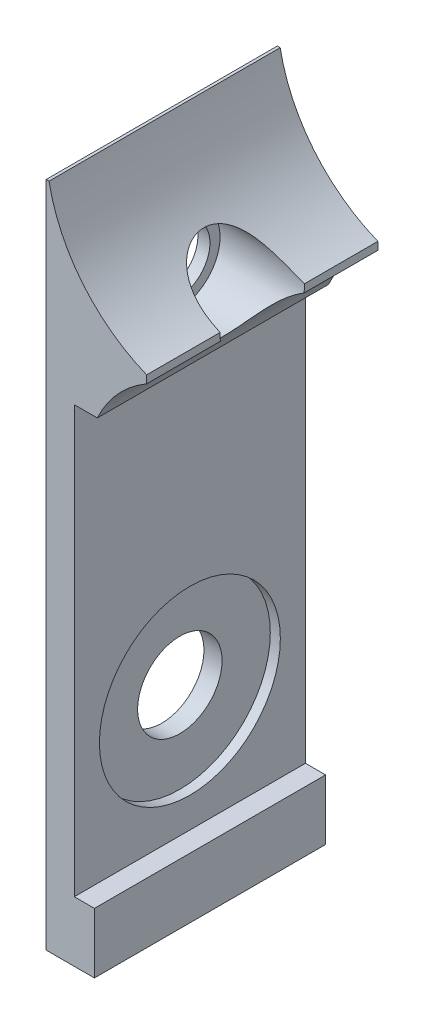
ISO-10303-21;
HEADER;
FILE_DESCRIPTION(('STEP AP214'),'2;1');
FILE_NAME('part.step','',(''),(''),'','','');
FILE_SCHEMA(('AUTOMOTIVE_DESIGN { 1 0 10303 214 1 1 1 1 }'));
ENDSEC;
DATA;
#1=APPLICATION_CONTEXT('core data for automotive mechanical design processes');
#2=APPLICATION_PROTOCOL_DEFINITION('international standard','automotive_design',2000,#1);
#3=PRODUCT_CONTEXT('',#1,'mechanical');
#4=PRODUCT('Part','Part','',(#3));
#5=PRODUCT_RELATED_PRODUCT_CATEGORY('part','',(#4));
#6=PRODUCT_DEFINITION_FORMATION('','',#4);
#7=PRODUCT_DEFINITION_CONTEXT('part definition',#1,'design');
#8=PRODUCT_DEFINITION('design','',#6,#7);
#9=PRODUCT_DEFINITION_SHAPE('','',#8);
#10=(LENGTH_UNIT() NAMED_UNIT(*) SI_UNIT(.MILLI.,.METRE.));
#11=(NAMED_UNIT(*) PLANE_ANGLE_UNIT() SI_UNIT($,.RADIAN.));
#12=(NAMED_UNIT(*) SI_UNIT($,.STERADIAN.) SOLID_ANGLE_UNIT());
#13=UNCERTAINTY_MEASURE_WITH_UNIT(LENGTH_MEASURE(1.E-05),#10,'distance_accuracy_value','');
#14=(GEOMETRIC_REPRESENTATION_CONTEXT(3) GLOBAL_UNCERTAINTY_ASSIGNED_CONTEXT((#13)) GLOBAL_UNIT_ASSIGNED_CONTEXT((#10,
#11,#12)) REPRESENTATION_CONTEXT('',''));
#15=CARTESIAN_POINT('',(0.,0.,0.));
#16=DIRECTION('',(0.,0.,1.));
#17=DIRECTION('',(1.,0.,0.));
#18=AXIS2_PLACEMENT_3D('',#15,#16,#17);
#19=CARTESIAN_POINT('',(-84.253382481582,10.8635198135198,11.5));
#20=DIRECTION('',(-1.,0.,0.));
#21=DIRECTION('',(0.,0.,1.));
#22=AXIS2_PLACEMENT_3D('',#19,#20,#21);
#23=PLANE('',#22);
#24=DIRECTION('',(0.,1.,0.));
#25=VECTOR('',#24,1.);
#26=CARTESIAN_POINT('',(-84.253382481582,10.8635198135198,11.5));
#27=LINE('',#26,#25);
#28=CARTESIAN_POINT('',(-84.253382481582,13.5596722362264,11.5));
#29=VERTEX_POINT('',#28);
#30=CARTESIAN_POINT('',(-84.253382481582,13.9473213264241,11.5));
#31=VERTEX_POINT('',#30);
#32=EDGE_CURVE('E135',#29,#31,#27,.T.);
#33=ORIENTED_EDGE('',*,*,#32,.F.);
#34=DIRECTION('',(0.,0.,1.));
#35=VECTOR('',#34,1.);
#36=CARTESIAN_POINT('',(-84.253382481582,13.5596722362264,0.));
#37=LINE('',#36,#35);
#38=CARTESIAN_POINT('',(-84.253382481582,13.5596722362264,7.82790198271549));
#39=VERTEX_POINT('',#38);
#40=EDGE_CURVE('E207',#29,#39,#37,.F.);
#41=ORIENTED_EDGE('',*,*,#40,.T.);
#42=CARTESIAN_POINT('',(-84.253382481582,13.8635198135198,5.75));
#43=DIRECTION('',(1.,0.,0.));
#44=DIRECTION('',(0.,0.,-1.));
#45=AXIS2_PLACEMENT_3D('',#42,#43,#44);
#46=CIRCLE('',#45,2.1);
#47=CARTESIAN_POINT('',(-84.253382481582,13.9473213264241,7.84832726390212));
#48=VERTEX_POINT('',#47);
#49=EDGE_CURVE('E154',#48,#39,#46,.T.);
#50=ORIENTED_EDGE('',*,*,#49,.F.);
#51=DIRECTION('',(0.,0.,1.));
#52=VECTOR('',#51,1.);
#53=CARTESIAN_POINT('',(-84.253382481582,13.9473213264241,0.));
#54=LINE('',#53,#52);
#55=EDGE_CURVE('E126',#48,#31,#54,.T.);
#56=ORIENTED_EDGE('',*,*,#55,.T.);
#57=EDGE_LOOP('',(#33,#41,#50,#56));
#58=FACE_BOUND('',#57,.T.);
#59=ADVANCED_FACE('F32',(#58),#23,.F.);
#60=CARTESIAN_POINT('',(-89.2533824815821,13.8635198135198,5.75));
#61=DIRECTION('',(1.,0.,0.));
#62=DIRECTION('',(0.,0.,-1.));
#63=AXIS2_PLACEMENT_3D('',#60,#61,#62);
#64=CYLINDRICAL_SURFACE('',#63,2.1);
#65=ORIENTED_EDGE('',*,*,#49,.T.);
#66=CARTESIAN_POINT('',(-84.253382481582,13.5596722362264,7.82790198271549));
#67=CARTESIAN_POINT('',(-84.329372968283,13.51581055337,7.8214758453593));
#68=CARTESIAN_POINT('',(-84.4043158935709,13.4703085241428,7.81341435107651));
#69=CARTESIAN_POINT('',(-84.5518784734901,13.3762597621513,7.79325951894115));
#70=CARTESIAN_POINT('',(-84.6244940621987,13.3277080974361,7.78115950611244));
#71=CARTESIAN_POINT('',(-84.7676679897149,13.2274192268118,7.7520305151862));
#72=CARTESIAN_POINT('',(-84.8381966596658,13.1756538881626,7.73495103627666));
#73=CARTESIAN_POINT('',(-84.9758724505173,13.0699626332378,7.69511074250425));
#74=CARTESIAN_POINT('',(-85.043021829497,13.0160382041426,7.67235378363589));
#75=CARTESIAN_POINT('',(-85.2085195171252,12.8772699537405,7.60633471741659));
#76=CARTESIAN_POINT('',(-85.3042817454718,12.7913567926067,7.55862145416147));
#77=CARTESIAN_POINT('',(-85.4841340850374,12.6198212102236,7.44520293700197));
#78=CARTESIAN_POINT('',(-85.5682714971948,12.5341990820788,7.37957403576662));
#79=CARTESIAN_POINT('',(-85.710598696955,12.3812763791868,7.24059060653614));
#80=CARTESIAN_POINT('',(-85.7707870242759,12.3132278892183,7.17012553891527));
#81=CARTESIAN_POINT('',(-85.8802537001191,12.1844115091923,7.01520016766046));
#82=CARTESIAN_POINT('',(-85.9295273064635,12.1236467889945,6.93073380856484));
#83=CARTESIAN_POINT('',(-86.0163414974848,12.0130702373942,6.7486202039124));
#84=CARTESIAN_POINT('',(-86.0538124995794,11.9633238570164,6.6508994761196));
#85=CARTESIAN_POINT('',(-86.1159896376036,11.8788905774885,6.44538785526319));
#86=CARTESIAN_POINT('',(-86.1407023062407,11.8441959727654,6.33760214927018));
#87=CARTESIAN_POINT('',(-86.1751058785957,11.7953456363587,6.12806529058891));
#88=CARTESIAN_POINT('',(-86.1861545324255,11.7793445370311,6.02696265317353));
#89=CARTESIAN_POINT('',(-86.1979197112154,11.7622942267008,5.82292250237693));
#90=CARTESIAN_POINT('',(-86.1986398735105,11.761239752019,5.71998564773036));
#91=CARTESIAN_POINT('',(-86.1899630588206,11.7738303866122,5.52037149003759));
#92=CARTESIAN_POINT('',(-86.1810428960826,11.7867827321437,5.42362836992542));
#93=CARTESIAN_POINT('',(-86.1538685178083,11.8255700598249,5.2341411094351));
#94=CARTESIAN_POINT('',(-86.1356155185176,11.8514033633309,5.14139644968903));
#95=CARTESIAN_POINT('',(-86.0897171363914,11.9147727107065,4.96162090888131));
#96=CARTESIAN_POINT('',(-86.0619992504151,11.9523989022877,4.87464051562318));
#97=CARTESIAN_POINT('',(-85.9974951389084,12.0372408465453,4.7091543399511));
#98=CARTESIAN_POINT('',(-85.9607066936891,12.0844589459929,4.63065063867043));
#99=CARTESIAN_POINT('',(-85.8760606286418,12.1891739057872,4.47894955257474));
#100=CARTESIAN_POINT('',(-85.8276659715911,12.2471211837089,4.40636504812163));
#101=CARTESIAN_POINT('',(-85.722131310057,12.3681100302692,4.2728817901083));
#102=CARTESIAN_POINT('',(-85.6649919238254,12.4311512386187,4.21198221111007));
#103=CARTESIAN_POINT('',(-85.5170754894713,12.5868761095039,4.07826161811393));
#104=CARTESIAN_POINT('',(-85.4223002769841,12.6808078826417,4.01131249310686));
#105=CARTESIAN_POINT('',(-85.2197136643078,12.8676672816973,3.89788570311952));
#106=CARTESIAN_POINT('',(-85.1118430824014,12.9605881123594,3.8515057419756));
#107=CARTESIAN_POINT('',(-84.9410689895197,13.0970729567311,3.7942186703956));
#108=CARTESIAN_POINT('',(-84.8817686478396,13.1426915142717,3.7770230803508));
#109=CARTESIAN_POINT('',(-84.760816075351,13.23214974561,3.74660173907473));
#110=CARTESIAN_POINT('',(-84.6991632289342,13.2759889475022,3.73337703509487));
#111=CARTESIAN_POINT('',(-84.5744675904041,13.3611226816438,3.71050941585353));
#112=CARTESIAN_POINT('',(-84.5114461620633,13.4024390827758,3.70083038416082));
#113=CARTESIAN_POINT('',(-84.383670896336,13.4827971109071,3.68439538126007));
#114=CARTESIAN_POINT('',(-84.3189185963322,13.5218406647322,3.67763690195736));
#115=CARTESIAN_POINT('',(-84.253382481582,13.5596722362264,3.67209801728451));
#116=B_SPLINE_CURVE_WITH_KNOTS('',3,(#66,#67,#68,#69,#70,#71,#72,#73,#74,#75,#76,#77,#78,#79,
#80,#81,#82,#83,#84,#85,#86,#87,#88,#89,#90,#91,#92,#93,#94,#95,#96,#97,#98,#99,#100,#101,#102,
#103,#104,#105,#106,#107,#108,#109,#110,#111,#112,#113,#114,#115),.UNSPECIFIED.,.F.,.F.,(4,2,2,
2,2,2,2,2,2,2,2,2,2,2,2,2,2,2,2,2,2,2,2,2,4),(0.,0.263938029091296,0.528314480666565,
0.795471449168201,1.06244746332298,1.47263355467081,1.88109809891275,2.22458933829354,
2.56822952473012,2.91385929103055,3.25931190698916,3.56660671567903,3.87379330318464,
4.16645348751784,4.45907554239977,4.75399139381819,5.04897948689953,5.36190397616779,
5.67480635190635,6.12020820975114,6.56770364773846,6.79787658000081,7.02811016311793,
7.25592868545954,7.48355117246578),.UNSPECIFIED.);
#117=CARTESIAN_POINT('',(-84.253382481582,13.5596722362264,3.67209801728451));
#118=VERTEX_POINT('',#117);
#119=EDGE_CURVE('E205',#39,#118,#116,.T.);
#120=ORIENTED_EDGE('',*,*,#119,.T.);
#121=CARTESIAN_POINT('',(-84.253382481582,13.9473213264241,3.65167273609788));
#122=VERTEX_POINT('',#121);
#123=EDGE_CURVE('E203',#118,#122,#46,.T.);
#124=ORIENTED_EDGE('',*,*,#123,.T.);
#125=CARTESIAN_POINT('',(-84.253382481582,13.9473213264241,3.65167273609788));
#126=CARTESIAN_POINT('',(-84.3180912384306,13.9734971417131,3.65272024728984));
#127=CARTESIAN_POINT('',(-84.3824473779132,14.0005163437054,3.65428756603544));
#128=CARTESIAN_POINT('',(-84.5104060408374,14.0562174161101,3.6586726945352));
#129=CARTESIAN_POINT('',(-84.5740084268045,14.0848995843709,3.66149072890617));
#130=CARTESIAN_POINT('',(-84.7639785548422,14.1735769369275,3.67215905894475));
#131=CARTESIAN_POINT('',(-84.8890978701581,14.2360365315159,3.68221963723988));
#132=CARTESIAN_POINT('',(-85.1371010719386,14.3680389280584,3.71037129737212));
#133=CARTESIAN_POINT('',(-85.2599226273181,14.4376744862007,3.72858140711455));
#134=CARTESIAN_POINT('',(-85.5001216224567,14.5823092530845,3.77538361416038));
#135=CARTESIAN_POINT('',(-85.6175073061699,14.6572998698729,3.80395936802209));
#136=CARTESIAN_POINT('',(-85.8531435277827,14.8164824550533,3.87649585962068));
#137=CARTESIAN_POINT('',(-85.9709394106751,14.9009550342442,3.92134785038265));
#138=CARTESIAN_POINT('',(-86.1960646418588,15.0714861432522,4.0292617524623));
#139=CARTESIAN_POINT('',(-86.3034355723817,15.1575365943624,4.09224697763476));
#140=CARTESIAN_POINT('',(-86.4870602651269,15.3120400281861,4.22673335952707));
#141=CARTESIAN_POINT('',(-86.5654622029473,15.3809198855004,4.29477314304346));
#142=CARTESIAN_POINT('',(-86.7108417343898,15.5132405345076,4.44672256333884));
#143=CARTESIAN_POINT('',(-86.7778283285144,15.5766855914896,4.53061958625187));
#144=CARTESIAN_POINT('',(-86.8856292868598,15.6817677343848,4.69570664438384));
#145=CARTESIAN_POINT('',(-86.9289981637965,15.7252260770462,4.77406051599587));
#146=CARTESIAN_POINT('',(-87.0053318778576,15.8031191451312,4.93986115781878));
#147=CARTESIAN_POINT('',(-87.0383012181073,15.8375577751005,5.0273039705403));
#148=CARTESIAN_POINT('',(-87.0927709043206,15.8951431558668,5.20989051541464));
#149=CARTESIAN_POINT('',(-87.1142015328846,15.9182211952491,5.30507714616621));
#150=CARTESIAN_POINT('',(-87.1443775963361,15.9508783052746,5.49969625849586));
#151=CARTESIAN_POINT('',(-87.1531286700893,15.9604633764716,5.59912683243699));
#152=CARTESIAN_POINT('',(-87.1573517629946,15.965080803113,5.78835277603095));
#153=CARTESIAN_POINT('',(-87.1540935662859,15.9615047904987,5.87809052924471));
#154=CARTESIAN_POINT('',(-87.137196421526,15.9431058126793,6.05538466168722));
#155=CARTESIAN_POINT('',(-87.12355957334,15.9282851225603,6.14294147847459));
#156=CARTESIAN_POINT('',(-87.0867085221138,15.8887583961533,6.31197747740665));
#157=CARTESIAN_POINT('',(-87.0636647571653,15.8642285037345,6.39353580011203));
#158=CARTESIAN_POINT('',(-87.0087465649679,15.8067799945392,6.55045504006698));
#159=CARTESIAN_POINT('',(-86.9768703890534,15.7738597167142,6.62581472625766));
#160=CARTESIAN_POINT('',(-86.9021055633461,15.6982772622258,6.77531477660854));
#161=CARTESIAN_POINT('',(-86.8585072480528,15.6550219795457,6.84879713903719));
#162=CARTESIAN_POINT('',(-86.763211008199,15.5629858328503,6.98639902930769));
#163=CARTESIAN_POINT('',(-86.7115086469296,15.5142019461753,7.05051339109486));
#164=CARTESIAN_POINT('',(-86.5720389708646,15.3864922171214,7.20077939097174));
#165=CARTESIAN_POINT('',(-86.4796463728335,15.3052553038131,7.28068471723836));
#166=CARTESIAN_POINT('',(-86.282499643002,15.140613377656,7.4205601717793));
#167=CARTESIAN_POINT('',(-86.1777173972413,15.0572037822006,7.4804837351752));
#168=CARTESIAN_POINT('',(-85.9850235537873,14.9119691516561,7.57104861081504));
#169=CARTESIAN_POINT('',(-85.8990421290898,14.849737192055,7.6052650148681));
#170=CARTESIAN_POINT('',(-85.7226391503281,14.7274621111163,7.66526666900529));
#171=CARTESIAN_POINT('',(-85.6322149490334,14.6674203328484,7.69104682052064));
#172=CARTESIAN_POINT('',(-85.4475507641421,14.5502278109647,7.73554028195716));
#173=CARTESIAN_POINT('',(-85.3533022684858,14.4930842343798,7.75423674840007));
#174=CARTESIAN_POINT('',(-85.1618212726159,14.3823781220152,7.78570449339462));
#175=CARTESIAN_POINT('',(-85.0645896195789,14.3288145830385,7.798477437842));
#176=CARTESIAN_POINT('',(-84.850022400503,14.2163989634061,7.82107153593022));
#177=CARTESIAN_POINT('',(-84.7321935484591,14.1583069208804,7.82996023910065));
#178=CARTESIAN_POINT('',(-84.4944146706282,14.0482744975926,7.84257381826727));
#179=CARTESIAN_POINT('',(-84.3744850928024,13.9962941483375,7.84633417278895));
#180=CARTESIAN_POINT('',(-84.253382481582,13.9473213264241,7.84832726390212));
#181=B_SPLINE_CURVE_WITH_KNOTS('',3,(#125,#126,#127,#128,#129,#130,#131,#132,#133,#134,#135,
#136,#137,#138,#139,#140,#141,#142,#143,#144,#145,#146,#147,#148,#149,#150,#151,#152,#153,#154,
#155,#156,#157,#158,#159,#160,#161,#162,#163,#164,#165,#166,#167,#168,#169,#170,#171,#172,#173,
#174,#175,#176,#177,#178,#179,#180),.UNSPECIFIED.,.F.,.F.,(4,2,2,2,2,2,2,2,2,2,2,2,2,2,2,2,2,2,
2,2,2,2,2,2,2,2,2,4),(0.,0.209415712211946,0.418869048754785,0.839104601265873,1.26568903995458,
1.69160378867589,2.14564065052749,2.59778489085653,2.9701818592758,3.34228383654508,
3.63970443219158,3.93699606375813,4.23606434193229,4.53499957726439,4.80327776052113,
5.07150167870219,5.33506748222841,5.59868550458066,5.88489610189497,6.17126394129366,
6.60888374886384,7.04751635887815,7.38162029023721,7.71592577071692,8.05102124207332,
8.38602241595656,8.78075799858315,9.17274865949271),.UNSPECIFIED.);
#182=EDGE_CURVE('E209',#122,#48,#181,.T.);
#183=ORIENTED_EDGE('',*,*,#182,.T.);
#184=EDGE_LOOP('',(#65,#120,#124,#183));
#185=FACE_BOUND('',#184,.T.);
#186=CARTESIAN_POINT('',(-88.453382481582,13.8635198135198,5.75));
#187=DIRECTION('',(-1.,0.,0.));
#188=DIRECTION('',(0.,0.,1.));
#189=AXIS2_PLACEMENT_3D('',#186,#187,#188);
#190=CIRCLE('',#189,2.1);
#191=CARTESIAN_POINT('',(-88.453382481582,13.8635198135198,7.85));
#192=VERTEX_POINT('',#191);
#193=EDGE_CURVE('E186',#192,#192,#190,.F.);
#194=ORIENTED_EDGE('',*,*,#193,.F.);
#195=EDGE_LOOP('',(#194));
#196=FACE_BOUND('',#195,.T.);
#197=ADVANCED_FACE('F271',(#185,#196),#64,.F.);
#198=CARTESIAN_POINT('',(-89.2533824815821,-4.33648018648019,5.75));
#199=DIRECTION('',(1.,0.,0.));
#200=DIRECTION('',(0.,0.,-1.));
#201=AXIS2_PLACEMENT_3D('',#198,#199,#200);
#202=CYLINDRICAL_SURFACE('',#201,2.1);
#203=CARTESIAN_POINT('',(-89.2533824815821,-4.33648018648019,5.75));
#204=DIRECTION('',(1.,0.,0.));
#205=DIRECTION('',(0.,0.,-1.));
#206=AXIS2_PLACEMENT_3D('',#203,#204,#205);
#207=CIRCLE('',#206,2.1);
#208=CARTESIAN_POINT('',(-89.2533824815821,-4.33648018648019,3.65));
#209=VERTEX_POINT('',#208);
#210=EDGE_CURVE('E190',#209,#209,#207,.T.);
#211=ORIENTED_EDGE('',*,*,#210,.F.);
#212=EDGE_LOOP('',(#211));
#213=FACE_BOUND('',#212,.T.);
#214=CARTESIAN_POINT('',(-88.353382481582,-4.33648018648019,5.75));
#215=DIRECTION('',(1.,0.,0.));
#216=DIRECTION('',(0.,0.,-1.));
#217=AXIS2_PLACEMENT_3D('',#214,#215,#216);
#218=CIRCLE('',#217,2.1);
#219=CARTESIAN_POINT('',(-88.353382481582,-4.33648018648019,3.65));
#220=VERTEX_POINT('',#219);
#221=EDGE_CURVE('E187',#220,#220,#218,.F.);
#222=ORIENTED_EDGE('',*,*,#221,.F.);
#223=EDGE_LOOP('',(#222));
#224=FACE_BOUND('',#223,.T.);
#225=ADVANCED_FACE('F276',(#213,#224),#202,.F.);
#226=CARTESIAN_POINT('',(-89.2533824815821,-13.3364801864802,11.5));
#227=DIRECTION('',(0.,1.,0.));
#228=DIRECTION('',(0.,0.,1.));
#229=AXIS2_PLACEMENT_3D('',#226,#227,#228);
#230=PLANE('',#229);
#231=DIRECTION('',(1.,0.,0.));
#232=VECTOR('',#231,1.);
#233=CARTESIAN_POINT('',(-89.2533824815821,-13.3364801864802,0.));
#234=LINE('',#233,#232);
#235=CARTESIAN_POINT('',(-89.2533824815821,-13.3364801864802,0.));
#236=VERTEX_POINT('',#235);
#237=CARTESIAN_POINT('',(-86.853382481582,-13.3364801864802,0.));
#238=VERTEX_POINT('',#237);
#239=EDGE_CURVE('E150',#236,#238,#234,.T.);
#240=ORIENTED_EDGE('',*,*,#239,.T.);
#241=DIRECTION('',(0.,0.,-1.));
#242=VECTOR('',#241,1.);
#243=CARTESIAN_POINT('',(-86.853382481582,-13.3364801864802,11.5));
#244=LINE('',#243,#242);
#245=CARTESIAN_POINT('',(-86.853382481582,-13.3364801864802,11.5));
#246=VERTEX_POINT('',#245);
#247=EDGE_CURVE('E183',#246,#238,#244,.T.);
#248=ORIENTED_EDGE('',*,*,#247,.F.);
#249=DIRECTION('',(1.,0.,0.));
#250=VECTOR('',#249,1.);
#251=CARTESIAN_POINT('',(-89.2533824815821,-13.3364801864802,11.5));
#252=LINE('',#251,#250);
#253=CARTESIAN_POINT('',(-89.2533824815821,-13.3364801864802,11.5));
#254=VERTEX_POINT('',#253);
#255=EDGE_CURVE('E170',#254,#246,#252,.T.);
#256=ORIENTED_EDGE('',*,*,#255,.F.);
#257=DIRECTION('',(0.,0.,-1.));
#258=VECTOR('',#257,1.);
#259=CARTESIAN_POINT('',(-89.2533824815821,-13.3364801864802,11.5));
#260=LINE('',#259,#258);
#261=EDGE_CURVE('E144',#254,#236,#260,.T.);
#262=ORIENTED_EDGE('',*,*,#261,.T.);
#263=EDGE_LOOP('',(#240,#248,#256,#262));
#264=FACE_BOUND('',#263,.T.);
#265=ADVANCED_FACE('F34',(#264),#230,.F.);
#266=CARTESIAN_POINT('',(-86.853382481582,-13.3364801864802,11.5));
#267=DIRECTION('',(-1.,0.,0.));
#268=DIRECTION('',(0.,0.,1.));
#269=AXIS2_PLACEMENT_3D('',#266,#267,#268);
#270=PLANE('',#269);
#271=DIRECTION('',(0.,1.,0.));
#272=VECTOR('',#271,1.);
#273=CARTESIAN_POINT('',(-86.853382481582,-13.3364801864802,0.));
#274=LINE('',#273,#272);
#275=CARTESIAN_POINT('',(-86.853382481582,-10.3364801864802,0.));
#276=VERTEX_POINT('',#275);
#277=EDGE_CURVE('E153',#238,#276,#274,.T.);
#278=ORIENTED_EDGE('',*,*,#277,.T.);
#279=DIRECTION('',(0.,0.,-1.));
#280=VECTOR('',#279,1.);
#281=CARTESIAN_POINT('',(-86.853382481582,-10.3364801864802,11.5));
#282=LINE('',#281,#280);
#283=CARTESIAN_POINT('',(-86.853382481582,-10.3364801864802,11.5));
#284=VERTEX_POINT('',#283);
#285=EDGE_CURVE('E180',#284,#276,#282,.T.);
#286=ORIENTED_EDGE('',*,*,#285,.F.);
#287=DIRECTION('',(0.,1.,0.));
#288=VECTOR('',#287,1.);
#289=CARTESIAN_POINT('',(-86.853382481582,-13.3364801864802,11.5));
#290=LINE('',#289,#288);
#291=EDGE_CURVE('E249',#246,#284,#290,.T.);
#292=ORIENTED_EDGE('',*,*,#291,.F.);
#293=ORIENTED_EDGE('',*,*,#247,.T.);
#294=EDGE_LOOP('',(#278,#286,#292,#293));
#295=FACE_BOUND('',#294,.T.);
#296=ADVANCED_FACE('F295',(#295),#270,.F.);
#297=CARTESIAN_POINT('',(-86.853382481582,-10.3364801864802,11.5));
#298=DIRECTION('',(0.,-1.,0.));
#299=DIRECTION('',(0.,0.,-1.));
#300=AXIS2_PLACEMENT_3D('',#297,#298,#299);
#301=PLANE('',#300);
#302=DIRECTION('',(-1.,0.,0.));
#303=VECTOR('',#302,1.);
#304=CARTESIAN_POINT('',(-86.853382481582,-10.3364801864802,0.));
#305=LINE('',#304,#303);
#306=CARTESIAN_POINT('',(-87.853382481582,-10.3364801864802,0.));
#307=VERTEX_POINT('',#306);
#308=EDGE_CURVE('E156',#276,#307,#305,.T.);
#309=ORIENTED_EDGE('',*,*,#308,.T.);
#310=DIRECTION('',(0.,0.,-1.));
#311=VECTOR('',#310,1.);
#312=CARTESIAN_POINT('',(-87.853382481582,-10.3364801864802,11.5));
#313=LINE('',#312,#311);
#314=CARTESIAN_POINT('',(-87.853382481582,-10.3364801864802,11.5));
#315=VERTEX_POINT('',#314);
#316=EDGE_CURVE('E177',#315,#307,#313,.T.);
#317=ORIENTED_EDGE('',*,*,#316,.F.);
#318=DIRECTION('',(-1.,0.,0.));
#319=VECTOR('',#318,1.);
#320=CARTESIAN_POINT('',(-86.853382481582,-10.3364801864802,11.5));
#321=LINE('',#320,#319);
#322=EDGE_CURVE('E251',#284,#315,#321,.T.);
#323=ORIENTED_EDGE('',*,*,#322,.F.);
#324=ORIENTED_EDGE('',*,*,#285,.T.);
#325=EDGE_LOOP('',(#309,#317,#323,#324));
#326=FACE_BOUND('',#325,.T.);
#327=ADVANCED_FACE('F290',(#326),#301,.F.);
#328=CARTESIAN_POINT('',(-87.853382481582,10.8635198135198,11.5));
#329=DIRECTION('',(-1.,0.,0.));
#330=DIRECTION('',(0.,0.,1.));
#331=AXIS2_PLACEMENT_3D('',#328,#329,#330);
#332=PLANE('',#331);
#333=CARTESIAN_POINT('',(-87.853382481582,-4.33648018648019,5.75));
#334=DIRECTION('',(1.,0.,0.));
#335=DIRECTION('',(0.,0.,-1.));
#336=AXIS2_PLACEMENT_3D('',#333,#334,#335);
#337=CIRCLE('',#336,4.5);
#338=CARTESIAN_POINT('',(-87.853382481582,-4.33648018648019,1.25));
#339=VERTEX_POINT('',#338);
#340=EDGE_CURVE('E237',#339,#339,#337,.T.);
#341=ORIENTED_EDGE('',*,*,#340,.F.);
#342=EDGE_LOOP('',(#341));
#343=FACE_BOUND('',#342,.T.);
#344=DIRECTION('',(0.,1.,0.));
#345=VECTOR('',#344,1.);
#346=CARTESIAN_POINT('',(-87.853382481582,10.8635198135198,0.));
#347=LINE('',#346,#345);
#348=CARTESIAN_POINT('',(-87.853382481582,10.8635198135198,0.));
#349=VERTEX_POINT('',#348);
#350=EDGE_CURVE('E158',#307,#349,#347,.T.);
#351=ORIENTED_EDGE('',*,*,#350,.T.);
#352=DIRECTION('',(0.,0.,-1.));
#353=VECTOR('',#352,1.);
#354=CARTESIAN_POINT('',(-87.853382481582,10.8635198135198,11.5));
#355=LINE('',#354,#353);
#356=CARTESIAN_POINT('',(-87.853382481582,10.8635198135198,11.5));
#357=VERTEX_POINT('',#356);
#358=EDGE_CURVE('E174',#357,#349,#355,.T.);
#359=ORIENTED_EDGE('',*,*,#358,.F.);
#360=DIRECTION('',(0.,1.,0.));
#361=VECTOR('',#360,1.);
#362=CARTESIAN_POINT('',(-87.853382481582,10.8635198135198,11.5));
#363=LINE('',#362,#361);
#364=EDGE_CURVE('E253',#315,#357,#363,.T.);
#365=ORIENTED_EDGE('',*,*,#364,.F.);
#366=ORIENTED_EDGE('',*,*,#316,.T.);
#367=EDGE_LOOP('',(#351,#359,#365,#366));
#368=FACE_BOUND('',#367,.T.);
#369=ADVANCED_FACE('F286',(#343,#368),#332,.F.);
#370=CARTESIAN_POINT('',(-87.853382481582,10.8635198135198,11.5));
#371=DIRECTION('',(0.,1.,0.));
#372=DIRECTION('',(0.,0.,1.));
#373=AXIS2_PLACEMENT_3D('',#370,#371,#372);
#374=PLANE('',#373);
#375=DIRECTION('',(1.,0.,0.));
#376=VECTOR('',#375,1.);
#377=CARTESIAN_POINT('',(-87.853382481582,10.8635198135198,0.));
#378=LINE('',#377,#376);
#379=CARTESIAN_POINT('',(-86.7077385388999,10.8635198135198,0.));
#380=VERTEX_POINT('',#379);
#381=EDGE_CURVE('E160',#349,#380,#378,.T.);
#382=ORIENTED_EDGE('',*,*,#381,.T.);
#383=DIRECTION('',(0.,0.,1.));
#384=VECTOR('',#383,1.);
#385=CARTESIAN_POINT('',(-86.7077385388999,10.8635198135198,0.));
#386=LINE('',#385,#384);
#387=CARTESIAN_POINT('',(-86.7077385388999,10.8635198135198,11.5));
#388=VERTEX_POINT('',#387);
#389=EDGE_CURVE('E47',#380,#388,#386,.T.);
#390=ORIENTED_EDGE('',*,*,#389,.T.);
#391=DIRECTION('',(1.,0.,0.));
#392=VECTOR('',#391,1.);
#393=CARTESIAN_POINT('',(-87.853382481582,10.8635198135198,11.5));
#394=LINE('',#393,#392);
#395=EDGE_CURVE('E146',#357,#388,#394,.T.);
#396=ORIENTED_EDGE('',*,*,#395,.F.);
#397=ORIENTED_EDGE('',*,*,#358,.T.);
#398=EDGE_LOOP('',(#382,#390,#396,#397));
#399=FACE_BOUND('',#398,.T.);
#400=ADVANCED_FACE('F256',(#399),#374,.F.);
#401=ORIENTED_EDGE('',*,*,#123,.F.);
#402=CARTESIAN_POINT('',(-84.253382481582,13.5596722362264,0.));
#403=VERTEX_POINT('',#402);
#404=EDGE_CURVE('E202',#118,#403,#37,.F.);
#405=ORIENTED_EDGE('',*,*,#404,.T.);
#406=DIRECTION('',(0.,1.,0.));
#407=VECTOR('',#406,1.);
#408=CARTESIAN_POINT('',(-84.253382481582,10.8635198135198,0.));
#409=LINE('',#408,#407);
#410=CARTESIAN_POINT('',(-84.253382481582,13.9473213264241,0.));
#411=VERTEX_POINT('',#410);
#412=EDGE_CURVE('E163',#403,#411,#409,.T.);
#413=ORIENTED_EDGE('',*,*,#412,.T.);
#414=EDGE_CURVE('E54',#411,#122,#54,.T.);
#415=ORIENTED_EDGE('',*,*,#414,.T.);
#416=EDGE_LOOP('',(#401,#405,#413,#415));
#417=FACE_BOUND('',#416,.T.);
#418=ADVANCED_FACE('F200',(#417),#23,.F.);
#419=CARTESIAN_POINT('',(-89.2533824815821,19.8635198135198,11.5));
#420=DIRECTION('',(0.,-1.,0.));
#421=DIRECTION('',(0.,0.,-1.));
#422=AXIS2_PLACEMENT_3D('',#419,#420,#421);
#423=PLANE('',#422);
#424=DIRECTION('',(-1.,0.,0.));
#425=VECTOR('',#424,1.);
#426=CARTESIAN_POINT('',(-89.2533824815821,19.8635198135198,11.5));
#427=LINE('',#426,#425);
#428=CARTESIAN_POINT('',(-89.1114993043329,19.8635198135198,11.5));
#429=VERTEX_POINT('',#428);
#430=CARTESIAN_POINT('',(-89.2533824815821,19.8635198135198,11.5));
#431=VERTEX_POINT('',#430);
#432=EDGE_CURVE('E132',#429,#431,#427,.T.);
#433=ORIENTED_EDGE('',*,*,#432,.F.);
#434=DIRECTION('',(0.,0.,1.));
#435=VECTOR('',#434,1.);
#436=CARTESIAN_POINT('',(-89.1114993043329,19.8635198135198,0.));
#437=LINE('',#436,#435);
#438=CARTESIAN_POINT('',(-89.1114993043329,19.8635198135198,0.));
#439=VERTEX_POINT('',#438);
#440=EDGE_CURVE('E118',#429,#439,#437,.F.);
#441=ORIENTED_EDGE('',*,*,#440,.T.);
#442=DIRECTION('',(-1.,0.,0.));
#443=VECTOR('',#442,1.);
#444=CARTESIAN_POINT('',(-89.2533824815821,19.8635198135198,0.));
#445=LINE('',#444,#443);
#446=CARTESIAN_POINT('',(-89.2533824815821,19.8635198135198,0.));
#447=VERTEX_POINT('',#446);
#448=EDGE_CURVE('E166',#439,#447,#445,.T.);
#449=ORIENTED_EDGE('',*,*,#448,.T.);
#450=DIRECTION('',(0.,0.,-1.));
#451=VECTOR('',#450,1.);
#452=CARTESIAN_POINT('',(-89.2533824815821,19.8635198135198,11.5));
#453=LINE('',#452,#451);
#454=EDGE_CURVE('E140',#431,#447,#453,.T.);
#455=ORIENTED_EDGE('',*,*,#454,.F.);
#456=EDGE_LOOP('',(#433,#441,#449,#455));
#457=FACE_BOUND('',#456,.T.);
#458=ADVANCED_FACE('F138',(#457),#423,.F.);
#459=CARTESIAN_POINT('',(-89.2533824815821,-13.3364801864802,11.5));
#460=DIRECTION('',(1.,0.,0.));
#461=DIRECTION('',(0.,0.,-1.));
#462=AXIS2_PLACEMENT_3D('',#459,#460,#461);
#463=PLANE('',#462);
#464=CARTESIAN_POINT('',(-89.2533824815821,13.8635198135198,5.75));
#465=DIRECTION('',(-1.,0.,0.));
#466=DIRECTION('',(0.,0.,1.));
#467=AXIS2_PLACEMENT_3D('',#464,#465,#466);
#468=CIRCLE('',#467,3.);
#469=CARTESIAN_POINT('',(-89.2533824815821,13.8635198135198,8.75));
#470=VERTEX_POINT('',#469);
#471=EDGE_CURVE('E232',#470,#470,#468,.T.);
#472=ORIENTED_EDGE('',*,*,#471,.F.);
#473=EDGE_LOOP('',(#472));
#474=FACE_BOUND('',#473,.T.);
#475=ORIENTED_EDGE('',*,*,#210,.T.);
#476=EDGE_LOOP('',(#475));
#477=FACE_BOUND('',#476,.T.);
#478=DIRECTION('',(0.,-1.,0.));
#479=VECTOR('',#478,1.);
#480=CARTESIAN_POINT('',(-89.2533824815821,-13.3364801864802,0.));
#481=LINE('',#480,#479);
#482=EDGE_CURVE('E168',#447,#236,#481,.T.);
#483=ORIENTED_EDGE('',*,*,#482,.T.);
#484=ORIENTED_EDGE('',*,*,#261,.F.);
#485=DIRECTION('',(0.,-1.,0.));
#486=VECTOR('',#485,1.);
#487=CARTESIAN_POINT('',(-89.2533824815821,-13.3364801864802,11.5));
#488=LINE('',#487,#486);
#489=EDGE_CURVE('E142',#431,#254,#488,.T.);
#490=ORIENTED_EDGE('',*,*,#489,.F.);
#491=ORIENTED_EDGE('',*,*,#454,.T.);
#492=EDGE_LOOP('',(#483,#484,#490,#491));
#493=FACE_BOUND('',#492,.T.);
#494=ADVANCED_FACE('F285',(#474,#477,#493),#463,.F.);
#495=CARTESIAN_POINT('',(0.,0.,11.5));
#496=DIRECTION('',(0.,0.,1.));
#497=DIRECTION('',(1.,0.,0.));
#498=AXIS2_PLACEMENT_3D('',#495,#496,#497);
#499=PLANE('',#498);
#500=CARTESIAN_POINT('',(-81.253382481582,8.36351981351981,11.5));
#501=DIRECTION('',(0.,0.,1.));
#502=DIRECTION('',(-1.,0.,0.));
#503=AXIS2_PLACEMENT_3D('',#500,#501,#502);
#504=CIRCLE('',#503,6.);
#505=EDGE_CURVE('E136',#29,#388,#504,.T.);
#506=ORIENTED_EDGE('',*,*,#505,.F.);
#507=ORIENTED_EDGE('',*,*,#32,.T.);
#508=CARTESIAN_POINT('',(-81.253382481582,21.3635198135198,11.5));
#509=DIRECTION('',(0.,0.,1.));
#510=DIRECTION('',(1.,0.,0.));
#511=AXIS2_PLACEMENT_3D('',#508,#509,#510);
#512=CIRCLE('',#511,8.00000000000001);
#513=EDGE_CURVE('E121',#429,#31,#512,.T.);
#514=ORIENTED_EDGE('',*,*,#513,.F.);
#515=ORIENTED_EDGE('',*,*,#432,.T.);
#516=ORIENTED_EDGE('',*,*,#489,.T.);
#517=ORIENTED_EDGE('',*,*,#255,.T.);
#518=ORIENTED_EDGE('',*,*,#291,.T.);
#519=ORIENTED_EDGE('',*,*,#322,.T.);
#520=ORIENTED_EDGE('',*,*,#364,.T.);
#521=ORIENTED_EDGE('',*,*,#395,.T.);
#522=EDGE_LOOP('',(#506,#507,#514,#515,#516,#517,#518,#519,#520,#521));
#523=FACE_BOUND('',#522,.T.);
#524=ADVANCED_FACE('F131',(#523),#499,.T.);
#525=CARTESIAN_POINT('',(0.,0.,0.));
#526=DIRECTION('',(0.,0.,1.));
#527=DIRECTION('',(1.,0.,0.));
#528=AXIS2_PLACEMENT_3D('',#525,#526,#527);
#529=PLANE('',#528);
#530=ORIENTED_EDGE('',*,*,#412,.F.);
#531=CARTESIAN_POINT('',(-81.253382481582,8.36351981351981,0.));
#532=DIRECTION('',(0.,0.,1.));
#533=DIRECTION('',(1.,0.,0.));
#534=AXIS2_PLACEMENT_3D('',#531,#532,#533);
#535=CIRCLE('',#534,6.);
#536=EDGE_CURVE('E11',#403,#380,#535,.T.);
#537=ORIENTED_EDGE('',*,*,#536,.T.);
#538=ORIENTED_EDGE('',*,*,#381,.F.);
#539=ORIENTED_EDGE('',*,*,#350,.F.);
#540=ORIENTED_EDGE('',*,*,#308,.F.);
#541=ORIENTED_EDGE('',*,*,#277,.F.);
#542=ORIENTED_EDGE('',*,*,#239,.F.);
#543=ORIENTED_EDGE('',*,*,#482,.F.);
#544=ORIENTED_EDGE('',*,*,#448,.F.);
#545=CARTESIAN_POINT('',(-81.253382481582,21.3635198135198,0.));
#546=DIRECTION('',(0.,0.,1.));
#547=DIRECTION('',(1.,0.,0.));
#548=AXIS2_PLACEMENT_3D('',#545,#546,#547);
#549=CIRCLE('',#548,8.00000000000001);
#550=EDGE_CURVE('E40',#439,#411,#549,.T.);
#551=ORIENTED_EDGE('',*,*,#550,.T.);
#552=EDGE_LOOP('',(#530,#537,#538,#539,#540,#541,#542,#543,#544,#551));
#553=FACE_BOUND('',#552,.T.);
#554=ADVANCED_FACE('F195',(#553),#529,.F.);
#555=CARTESIAN_POINT('',(-88.353382481582,-4.33648018648019,5.75));
#556=DIRECTION('',(1.,0.,0.));
#557=DIRECTION('',(0.,0.,-1.));
#558=AXIS2_PLACEMENT_3D('',#555,#556,#557);
#559=PLANE('',#558);
#560=CARTESIAN_POINT('',(-88.353382481582,-4.33648018648019,5.75));
#561=DIRECTION('',(1.,0.,0.));
#562=DIRECTION('',(0.,0.,-1.));
#563=AXIS2_PLACEMENT_3D('',#560,#561,#562);
#564=CIRCLE('',#563,4.5);
#565=CARTESIAN_POINT('',(-88.353382481582,-4.33648018648019,1.25));
#566=VERTEX_POINT('',#565);
#567=EDGE_CURVE('E191',#566,#566,#564,.T.);
#568=ORIENTED_EDGE('',*,*,#567,.T.);
#569=EDGE_LOOP('',(#568));
#570=FACE_BOUND('',#569,.T.);
#571=ORIENTED_EDGE('',*,*,#221,.T.);
#572=EDGE_LOOP('',(#571));
#573=FACE_BOUND('',#572,.T.);
#574=ADVANCED_FACE('F322',(#570,#573),#559,.T.);
#575=CARTESIAN_POINT('',(-88.353382481582,-4.33648018648019,5.75));
#576=DIRECTION('',(1.,0.,0.));
#577=DIRECTION('',(0.,0.,-1.));
#578=AXIS2_PLACEMENT_3D('',#575,#576,#577);
#579=CYLINDRICAL_SURFACE('',#578,4.5);
#580=ORIENTED_EDGE('',*,*,#567,.F.);
#581=EDGE_LOOP('',(#580));
#582=FACE_BOUND('',#581,.T.);
#583=ORIENTED_EDGE('',*,*,#340,.T.);
#584=EDGE_LOOP('',(#583));
#585=FACE_BOUND('',#584,.T.);
#586=ADVANCED_FACE('F328',(#582,#585),#579,.F.);
#587=CARTESIAN_POINT('',(-89.053382481582,13.8635198135198,5.75));
#588=DIRECTION('',(-1.,0.,0.));
#589=DIRECTION('',(0.,0.,1.));
#590=AXIS2_PLACEMENT_3D('',#587,#588,#589);
#591=PLANE('',#590);
#592=CARTESIAN_POINT('',(-89.053382481582,13.8635198135198,5.75));
#593=DIRECTION('',(-1.,0.,0.));
#594=DIRECTION('',(0.,0.,1.));
#595=AXIS2_PLACEMENT_3D('',#592,#593,#594);
#596=CIRCLE('',#595,3.);
#597=CARTESIAN_POINT('',(-89.053382481582,13.8635198135198,8.75));
#598=VERTEX_POINT('',#597);
#599=EDGE_CURVE('E234',#598,#598,#596,.T.);
#600=ORIENTED_EDGE('',*,*,#599,.T.);
#601=EDGE_LOOP('',(#600));
#602=FACE_BOUND('',#601,.T.);
#603=CARTESIAN_POINT('',(-89.053382481582,13.8635198135198,5.75));
#604=DIRECTION('',(-1.,0.,0.));
#605=DIRECTION('',(0.,0.,1.));
#606=AXIS2_PLACEMENT_3D('',#603,#604,#605);
#607=CIRCLE('',#606,1.6);
#608=CARTESIAN_POINT('',(-89.053382481582,13.8635198135198,7.35));
#609=VERTEX_POINT('',#608);
#610=EDGE_CURVE('E216',#609,#609,#607,.T.);
#611=ORIENTED_EDGE('',*,*,#610,.F.);
#612=EDGE_LOOP('',(#611));
#613=FACE_BOUND('',#612,.T.);
#614=ADVANCED_FACE('F351',(#602,#613),#591,.T.);
#615=CARTESIAN_POINT('',(-89.053382481582,13.8635198135198,5.75));
#616=DIRECTION('',(-1.,0.,0.));
#617=DIRECTION('',(0.,0.,1.));
#618=AXIS2_PLACEMENT_3D('',#615,#616,#617);
#619=CYLINDRICAL_SURFACE('',#618,3.);
#620=ORIENTED_EDGE('',*,*,#599,.F.);
#621=EDGE_LOOP('',(#620));
#622=FACE_BOUND('',#621,.T.);
#623=ORIENTED_EDGE('',*,*,#471,.T.);
#624=EDGE_LOOP('',(#623));
#625=FACE_BOUND('',#624,.T.);
#626=ADVANCED_FACE('F343',(#622,#625),#619,.F.);
#627=CARTESIAN_POINT('',(-88.453382481582,13.8635198135198,5.75));
#628=DIRECTION('',(-1.,0.,0.));
#629=DIRECTION('',(0.,0.,1.));
#630=AXIS2_PLACEMENT_3D('',#627,#628,#629);
#631=PLANE('',#630);
#632=CARTESIAN_POINT('',(-88.453382481582,13.8635198135198,5.75));
#633=DIRECTION('',(-1.,0.,0.));
#634=DIRECTION('',(0.,0.,1.));
#635=AXIS2_PLACEMENT_3D('',#632,#633,#634);
#636=CIRCLE('',#635,1.6);
#637=CARTESIAN_POINT('',(-88.453382481582,13.8635198135198,7.35));
#638=VERTEX_POINT('',#637);
#639=EDGE_CURVE('E222',#638,#638,#636,.T.);
#640=ORIENTED_EDGE('',*,*,#639,.T.);
#641=EDGE_LOOP('',(#640));
#642=FACE_BOUND('',#641,.T.);
#643=ORIENTED_EDGE('',*,*,#193,.T.);
#644=EDGE_LOOP('',(#643));
#645=FACE_BOUND('',#644,.T.);
#646=ADVANCED_FACE('F341',(#642,#645),#631,.F.);
#647=CARTESIAN_POINT('',(-88.453382481582,13.8635198135198,5.75));
#648=DIRECTION('',(-1.,0.,0.));
#649=DIRECTION('',(0.,0.,1.));
#650=AXIS2_PLACEMENT_3D('',#647,#648,#649);
#651=CYLINDRICAL_SURFACE('',#650,1.6);
#652=ORIENTED_EDGE('',*,*,#639,.F.);
#653=EDGE_LOOP('',(#652));
#654=FACE_BOUND('',#653,.T.);
#655=ORIENTED_EDGE('',*,*,#610,.T.);
#656=EDGE_LOOP('',(#655));
#657=FACE_BOUND('',#656,.T.);
#658=ADVANCED_FACE('F266',(#654,#657),#651,.F.);
#659=CARTESIAN_POINT('',(-81.253382481582,21.3635198135198,0.));
#660=DIRECTION('',(0.,0.,1.));
#661=DIRECTION('',(1.,0.,0.));
#662=AXIS2_PLACEMENT_3D('',#659,#660,#661);
#663=CYLINDRICAL_SURFACE('',#662,8.00000000000001);
#664=ORIENTED_EDGE('',*,*,#550,.F.);
#665=ORIENTED_EDGE('',*,*,#440,.F.);
#666=ORIENTED_EDGE('',*,*,#513,.T.);
#667=ORIENTED_EDGE('',*,*,#55,.F.);
#668=ORIENTED_EDGE('',*,*,#182,.F.);
#669=ORIENTED_EDGE('',*,*,#414,.F.);
#670=EDGE_LOOP('',(#664,#665,#666,#667,#668,#669));
#671=FACE_BOUND('',#670,.T.);
#672=ADVANCED_FACE('F120',(#671),#663,.F.);
#673=CARTESIAN_POINT('',(-81.253382481582,8.36351981351981,0.));
#674=DIRECTION('',(0.,0.,1.));
#675=DIRECTION('',(1.,0.,0.));
#676=AXIS2_PLACEMENT_3D('',#673,#674,#675);
#677=CYLINDRICAL_SURFACE('',#676,6.);
#678=ORIENTED_EDGE('',*,*,#536,.F.);
#679=ORIENTED_EDGE('',*,*,#404,.F.);
#680=ORIENTED_EDGE('',*,*,#119,.F.);
#681=ORIENTED_EDGE('',*,*,#40,.F.);
#682=ORIENTED_EDGE('',*,*,#505,.T.);
#683=ORIENTED_EDGE('',*,*,#389,.F.);
#684=EDGE_LOOP('',(#678,#679,#680,#681,#682,#683));
#685=FACE_BOUND('',#684,.T.);
#686=ADVANCED_FACE('F261',(#685),#677,.F.);
#687=CLOSED_SHELL('',(#59,#197,#225,#265,#296,#327,#369,#400,#418,#458,#494,#524,#554,#574,#586,
#614,#626,#646,#658,#672,#686));
#688=MANIFOLD_SOLID_BREP('B2',#687);
#689=ADVANCED_BREP_SHAPE_REPRESENTATION('',(#18,#688),#14);
#690=SHAPE_DEFINITION_REPRESENTATION(#9,#689);
ENDSEC;
END-ISO-10303-21;
